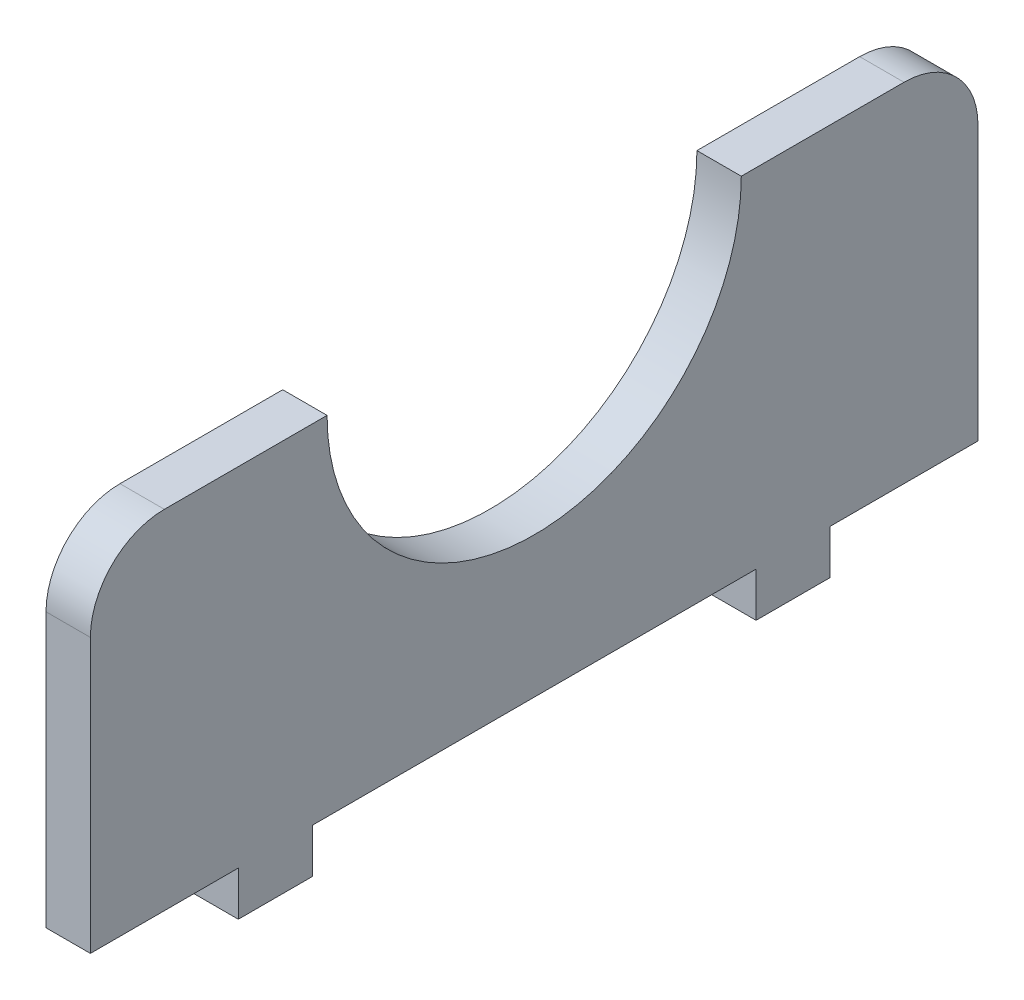
ISO-10303-21;
HEADER;
FILE_DESCRIPTION(('STEP AP214'),'2;1');
FILE_NAME('part.step','',(''),(''),'','','');
FILE_SCHEMA(('AUTOMOTIVE_DESIGN { 1 0 10303 214 1 1 1 1 }'));
ENDSEC;
DATA;
#1=APPLICATION_CONTEXT('core data for automotive mechanical design processes');
#2=APPLICATION_PROTOCOL_DEFINITION('international standard','automotive_design',2000,#1);
#3=PRODUCT_CONTEXT('',#1,'mechanical');
#4=PRODUCT('Part','Part','',(#3));
#5=PRODUCT_RELATED_PRODUCT_CATEGORY('part','',(#4));
#6=PRODUCT_DEFINITION_FORMATION('','',#4);
#7=PRODUCT_DEFINITION_CONTEXT('part definition',#1,'design');
#8=PRODUCT_DEFINITION('design','',#6,#7);
#9=PRODUCT_DEFINITION_SHAPE('','',#8);
#10=(LENGTH_UNIT() NAMED_UNIT(*) SI_UNIT(.MILLI.,.METRE.));
#11=(NAMED_UNIT(*) PLANE_ANGLE_UNIT() SI_UNIT($,.RADIAN.));
#12=(NAMED_UNIT(*) SI_UNIT($,.STERADIAN.) SOLID_ANGLE_UNIT());
#13=UNCERTAINTY_MEASURE_WITH_UNIT(LENGTH_MEASURE(1.E-05),#10,'distance_accuracy_value','');
#14=(GEOMETRIC_REPRESENTATION_CONTEXT(3) GLOBAL_UNCERTAINTY_ASSIGNED_CONTEXT((#13)) GLOBAL_UNIT_ASSIGNED_CONTEXT((#10,
#11,#12)) REPRESENTATION_CONTEXT('',''));
#15=CARTESIAN_POINT('',(0.,0.,0.));
#16=DIRECTION('',(0.,0.,1.));
#17=DIRECTION('',(1.,0.,0.));
#18=AXIS2_PLACEMENT_3D('',#15,#16,#17);
#19=CARTESIAN_POINT('',(3.,-11.75,-30.));
#20=DIRECTION('',(0.,1.,0.));
#21=DIRECTION('',(0.,0.,1.));
#22=AXIS2_PLACEMENT_3D('',#19,#20,#21);
#23=PLANE('',#22);
#24=DIRECTION('',(0.,0.,-1.));
#25=VECTOR('',#24,1.);
#26=CARTESIAN_POINT('',(0.,-11.75,-30.));
#27=LINE('',#26,#25);
#28=CARTESIAN_POINT('',(0.,-11.75,15.));
#29=VERTEX_POINT('',#28);
#30=CARTESIAN_POINT('',(0.,-11.75,-15.));
#31=VERTEX_POINT('',#30);
#32=EDGE_CURVE('E233',#29,#31,#27,.T.);
#33=ORIENTED_EDGE('',*,*,#32,.T.);
#34=DIRECTION('',(1.,0.,0.));
#35=VECTOR('',#34,1.);
#36=CARTESIAN_POINT('',(3.,-11.75,-15.));
#37=LINE('',#36,#35);
#38=CARTESIAN_POINT('',(3.,-11.75,-15.));
#39=VERTEX_POINT('',#38);
#40=EDGE_CURVE('E58',#31,#39,#37,.T.);
#41=ORIENTED_EDGE('',*,*,#40,.T.);
#42=DIRECTION('',(0.,0.,-1.));
#43=VECTOR('',#42,1.);
#44=CARTESIAN_POINT('',(3.,-11.75,-30.));
#45=LINE('',#44,#43);
#46=CARTESIAN_POINT('',(3.,-11.75,15.));
#47=VERTEX_POINT('',#46);
#48=EDGE_CURVE('E155',#47,#39,#45,.T.);
#49=ORIENTED_EDGE('',*,*,#48,.F.);
#50=DIRECTION('',(1.,0.,0.));
#51=VECTOR('',#50,1.);
#52=CARTESIAN_POINT('',(3.,-11.75,15.));
#53=LINE('',#52,#51);
#54=EDGE_CURVE('E190',#29,#47,#53,.T.);
#55=ORIENTED_EDGE('',*,*,#54,.F.);
#56=EDGE_LOOP('',(#33,#41,#49,#55));
#57=FACE_BOUND('',#56,.T.);
#58=ADVANCED_FACE('F35',(#57),#23,.F.);
#59=CARTESIAN_POINT('',(3.,-11.75,-20.));
#60=VERTEX_POINT('',#59);
#61=CARTESIAN_POINT('',(3.,-11.75,-30.));
#62=VERTEX_POINT('',#61);
#63=EDGE_CURVE('E50',#60,#62,#45,.T.);
#64=ORIENTED_EDGE('',*,*,#63,.F.);
#65=DIRECTION('',(-1.,0.,0.));
#66=VECTOR('',#65,1.);
#67=CARTESIAN_POINT('',(3.,-11.75,-20.));
#68=LINE('',#67,#66);
#69=CARTESIAN_POINT('',(0.,-11.75,-20.));
#70=VERTEX_POINT('',#69);
#71=EDGE_CURVE('E169',#60,#70,#68,.T.);
#72=ORIENTED_EDGE('',*,*,#71,.T.);
#73=CARTESIAN_POINT('',(0.,-11.75,-30.));
#74=VERTEX_POINT('',#73);
#75=EDGE_CURVE('E229',#70,#74,#27,.T.);
#76=ORIENTED_EDGE('',*,*,#75,.T.);
#77=DIRECTION('',(-1.,0.,0.));
#78=VECTOR('',#77,1.);
#79=CARTESIAN_POINT('',(3.,-11.75,-30.));
#80=LINE('',#79,#78);
#81=EDGE_CURVE('E247',#62,#74,#80,.T.);
#82=ORIENTED_EDGE('',*,*,#81,.F.);
#83=EDGE_LOOP('',(#64,#72,#76,#82));
#84=FACE_BOUND('',#83,.T.);
#85=ADVANCED_FACE('F296',(#84),#23,.F.);
#86=DIRECTION('',(-1.,0.,0.));
#87=VECTOR('',#86,1.);
#88=CARTESIAN_POINT('',(3.,-11.75,20.));
#89=LINE('',#88,#87);
#90=CARTESIAN_POINT('',(3.,-11.75,20.));
#91=VERTEX_POINT('',#90);
#92=CARTESIAN_POINT('',(0.,-11.75,20.));
#93=VERTEX_POINT('',#92);
#94=EDGE_CURVE('E158',#91,#93,#89,.T.);
#95=ORIENTED_EDGE('',*,*,#94,.F.);
#96=CARTESIAN_POINT('',(3.,-11.75,30.));
#97=VERTEX_POINT('',#96);
#98=EDGE_CURVE('E215',#97,#91,#45,.T.);
#99=ORIENTED_EDGE('',*,*,#98,.F.);
#100=DIRECTION('',(-1.,0.,0.));
#101=VECTOR('',#100,1.);
#102=CARTESIAN_POINT('',(3.,-11.75,30.));
#103=LINE('',#102,#101);
#104=CARTESIAN_POINT('',(0.,-11.75,30.));
#105=VERTEX_POINT('',#104);
#106=EDGE_CURVE('E250',#97,#105,#103,.T.);
#107=ORIENTED_EDGE('',*,*,#106,.T.);
#108=EDGE_CURVE('E230',#105,#93,#27,.T.);
#109=ORIENTED_EDGE('',*,*,#108,.T.);
#110=EDGE_LOOP('',(#95,#99,#107,#109));
#111=FACE_BOUND('',#110,.T.);
#112=ADVANCED_FACE('F283',(#111),#23,.F.);
#113=CARTESIAN_POINT('',(3.,-11.75,30.));
#114=DIRECTION('',(0.,0.,-1.));
#115=DIRECTION('',(0.,1.,0.));
#116=AXIS2_PLACEMENT_3D('',#113,#114,#115);
#117=PLANE('',#116);
#118=DIRECTION('',(0.,-1.,0.));
#119=VECTOR('',#118,1.);
#120=CARTESIAN_POINT('',(3.,-11.75,30.));
#121=LINE('',#120,#119);
#122=CARTESIAN_POINT('',(3.,6.75,30.));
#123=VERTEX_POINT('',#122);
#124=EDGE_CURVE('E212',#123,#97,#121,.T.);
#125=ORIENTED_EDGE('',*,*,#124,.F.);
#126=DIRECTION('',(-1.,0.,0.));
#127=VECTOR('',#126,1.);
#128=CARTESIAN_POINT('',(3.,6.75,30.));
#129=LINE('',#128,#127);
#130=CARTESIAN_POINT('',(0.,6.75,30.));
#131=VERTEX_POINT('',#130);
#132=EDGE_CURVE('E43',#123,#131,#129,.T.);
#133=ORIENTED_EDGE('',*,*,#132,.T.);
#134=DIRECTION('',(0.,-1.,0.));
#135=VECTOR('',#134,1.);
#136=CARTESIAN_POINT('',(0.,-11.75,30.));
#137=LINE('',#136,#135);
#138=EDGE_CURVE('E211',#131,#105,#137,.T.);
#139=ORIENTED_EDGE('',*,*,#138,.T.);
#140=ORIENTED_EDGE('',*,*,#106,.F.);
#141=EDGE_LOOP('',(#125,#133,#139,#140));
#142=FACE_BOUND('',#141,.T.);
#143=ADVANCED_FACE('F270',(#142),#117,.F.);
#144=CARTESIAN_POINT('',(3.,-11.75,-30.));
#145=DIRECTION('',(0.,0.,1.));
#146=DIRECTION('',(1.,0.,0.));
#147=AXIS2_PLACEMENT_3D('',#144,#145,#146);
#148=PLANE('',#147);
#149=DIRECTION('',(0.,1.,0.));
#150=VECTOR('',#149,1.);
#151=CARTESIAN_POINT('',(0.,-11.75,-30.));
#152=LINE('',#151,#150);
#153=CARTESIAN_POINT('',(0.,6.75,-30.));
#154=VERTEX_POINT('',#153);
#155=EDGE_CURVE('E232',#74,#154,#152,.T.);
#156=ORIENTED_EDGE('',*,*,#155,.T.);
#157=DIRECTION('',(-1.,0.,0.));
#158=VECTOR('',#157,1.);
#159=CARTESIAN_POINT('',(3.,6.75,-30.));
#160=LINE('',#159,#158);
#161=CARTESIAN_POINT('',(3.,6.75,-30.));
#162=VERTEX_POINT('',#161);
#163=EDGE_CURVE('E260',#154,#162,#160,.F.);
#164=ORIENTED_EDGE('',*,*,#163,.T.);
#165=DIRECTION('',(0.,1.,0.));
#166=VECTOR('',#165,1.);
#167=CARTESIAN_POINT('',(3.,-11.75,-30.));
#168=LINE('',#167,#166);
#169=EDGE_CURVE('E218',#62,#162,#168,.T.);
#170=ORIENTED_EDGE('',*,*,#169,.F.);
#171=ORIENTED_EDGE('',*,*,#81,.T.);
#172=EDGE_LOOP('',(#156,#164,#170,#171));
#173=FACE_BOUND('',#172,.T.);
#174=ADVANCED_FACE('F301',(#173),#148,.F.);
#175=CARTESIAN_POINT('',(3.,11.75,-30.));
#176=DIRECTION('',(0.,-1.,0.));
#177=DIRECTION('',(0.,0.,-1.));
#178=AXIS2_PLACEMENT_3D('',#175,#176,#177);
#179=PLANE('',#178);
#180=DIRECTION('',(0.,0.,1.));
#181=VECTOR('',#180,1.);
#182=CARTESIAN_POINT('',(3.,11.75,-30.));
#183=LINE('',#182,#181);
#184=CARTESIAN_POINT('',(3.,11.75,-25.));
#185=VERTEX_POINT('',#184);
#186=CARTESIAN_POINT('',(3.,11.75,-14.));
#187=VERTEX_POINT('',#186);
#188=EDGE_CURVE('E220',#185,#187,#183,.T.);
#189=ORIENTED_EDGE('',*,*,#188,.F.);
#190=DIRECTION('',(-1.,0.,0.));
#191=VECTOR('',#190,1.);
#192=CARTESIAN_POINT('',(3.,11.75,-25.));
#193=LINE('',#192,#191);
#194=CARTESIAN_POINT('',(0.,11.75,-25.));
#195=VERTEX_POINT('',#194);
#196=EDGE_CURVE('E253',#185,#195,#193,.T.);
#197=ORIENTED_EDGE('',*,*,#196,.T.);
#198=DIRECTION('',(0.,0.,1.));
#199=VECTOR('',#198,1.);
#200=CARTESIAN_POINT('',(0.,11.75,-30.));
#201=LINE('',#200,#199);
#202=CARTESIAN_POINT('',(0.,11.75,-14.));
#203=VERTEX_POINT('',#202);
#204=EDGE_CURVE('E236',#195,#203,#201,.T.);
#205=ORIENTED_EDGE('',*,*,#204,.T.);
#206=DIRECTION('',(-1.,0.,0.));
#207=VECTOR('',#206,1.);
#208=CARTESIAN_POINT('',(3.,11.75,-14.));
#209=LINE('',#208,#207);
#210=EDGE_CURVE('E244',#187,#203,#209,.T.);
#211=ORIENTED_EDGE('',*,*,#210,.F.);
#212=EDGE_LOOP('',(#189,#197,#205,#211));
#213=FACE_BOUND('',#212,.T.);
#214=ADVANCED_FACE('F310',(#213),#179,.F.);
#215=CARTESIAN_POINT('',(3.,11.75,0.));
#216=DIRECTION('',(-1.,0.,0.));
#217=DIRECTION('',(0.,0.,1.));
#218=AXIS2_PLACEMENT_3D('',#215,#216,#217);
#219=CYLINDRICAL_SURFACE('',#218,14.);
#220=CARTESIAN_POINT('',(0.,11.75,0.));
#221=DIRECTION('',(-1.,0.,0.));
#222=DIRECTION('',(0.,0.,-1.));
#223=AXIS2_PLACEMENT_3D('',#220,#221,#222);
#224=CIRCLE('',#223,14.);
#225=CARTESIAN_POINT('',(0.,11.75,14.));
#226=VERTEX_POINT('',#225);
#227=EDGE_CURVE('E238',#203,#226,#224,.T.);
#228=ORIENTED_EDGE('',*,*,#227,.T.);
#229=DIRECTION('',(-1.,0.,0.));
#230=VECTOR('',#229,1.);
#231=CARTESIAN_POINT('',(3.,11.75,14.));
#232=LINE('',#231,#230);
#233=CARTESIAN_POINT('',(3.,11.75,14.));
#234=VERTEX_POINT('',#233);
#235=EDGE_CURVE('E227',#234,#226,#232,.T.);
#236=ORIENTED_EDGE('',*,*,#235,.F.);
#237=CARTESIAN_POINT('',(3.,11.75,0.));
#238=DIRECTION('',(-1.,0.,0.));
#239=DIRECTION('',(0.,0.,-1.));
#240=AXIS2_PLACEMENT_3D('',#237,#238,#239);
#241=CIRCLE('',#240,14.);
#242=EDGE_CURVE('E222',#187,#234,#241,.T.);
#243=ORIENTED_EDGE('',*,*,#242,.F.);
#244=ORIENTED_EDGE('',*,*,#210,.T.);
#245=EDGE_LOOP('',(#228,#236,#243,#244));
#246=FACE_BOUND('',#245,.T.);
#247=ADVANCED_FACE('F353',(#246),#219,.F.);
#248=CARTESIAN_POINT('',(3.,11.75,14.));
#249=DIRECTION('',(0.,-1.,0.));
#250=DIRECTION('',(0.,0.,-1.));
#251=AXIS2_PLACEMENT_3D('',#248,#249,#250);
#252=PLANE('',#251);
#253=DIRECTION('',(0.,0.,1.));
#254=VECTOR('',#253,1.);
#255=CARTESIAN_POINT('',(0.,11.75,14.));
#256=LINE('',#255,#254);
#257=CARTESIAN_POINT('',(0.,11.75,25.));
#258=VERTEX_POINT('',#257);
#259=EDGE_CURVE('E214',#226,#258,#256,.T.);
#260=ORIENTED_EDGE('',*,*,#259,.T.);
#261=DIRECTION('',(-1.,0.,0.));
#262=VECTOR('',#261,1.);
#263=CARTESIAN_POINT('',(3.,11.75,25.));
#264=LINE('',#263,#262);
#265=CARTESIAN_POINT('',(3.,11.75,25.));
#266=VERTEX_POINT('',#265);
#267=EDGE_CURVE('E11',#258,#266,#264,.F.);
#268=ORIENTED_EDGE('',*,*,#267,.T.);
#269=DIRECTION('',(0.,0.,1.));
#270=VECTOR('',#269,1.);
#271=CARTESIAN_POINT('',(3.,11.75,14.));
#272=LINE('',#271,#270);
#273=EDGE_CURVE('E224',#234,#266,#272,.T.);
#274=ORIENTED_EDGE('',*,*,#273,.F.);
#275=ORIENTED_EDGE('',*,*,#235,.T.);
#276=EDGE_LOOP('',(#260,#268,#274,#275));
#277=FACE_BOUND('',#276,.T.);
#278=ADVANCED_FACE('F347',(#277),#252,.F.);
#279=CARTESIAN_POINT('',(3.,11.75,0.));
#280=DIRECTION('',(1.,0.,0.));
#281=DIRECTION('',(0.,0.,-1.));
#282=AXIS2_PLACEMENT_3D('',#279,#280,#281);
#283=PLANE('',#282);
#284=ORIENTED_EDGE('',*,*,#169,.T.);
#285=CARTESIAN_POINT('',(3.,6.75,-25.));
#286=DIRECTION('',(1.,0.,0.));
#287=DIRECTION('',(0.,0.,-1.));
#288=AXIS2_PLACEMENT_3D('',#285,#286,#287);
#289=CIRCLE('',#288,5.);
#290=EDGE_CURVE('E264',#162,#185,#289,.T.);
#291=ORIENTED_EDGE('',*,*,#290,.T.);
#292=ORIENTED_EDGE('',*,*,#188,.T.);
#293=ORIENTED_EDGE('',*,*,#242,.T.);
#294=ORIENTED_EDGE('',*,*,#273,.T.);
#295=CARTESIAN_POINT('',(3.,6.75,25.));
#296=DIRECTION('',(1.,0.,0.));
#297=DIRECTION('',(0.,0.,-1.));
#298=AXIS2_PLACEMENT_3D('',#295,#296,#297);
#299=CIRCLE('',#298,5.);
#300=EDGE_CURVE('E262',#266,#123,#299,.T.);
#301=ORIENTED_EDGE('',*,*,#300,.T.);
#302=ORIENTED_EDGE('',*,*,#124,.T.);
#303=ORIENTED_EDGE('',*,*,#98,.T.);
#304=DIRECTION('',(0.,1.,0.));
#305=VECTOR('',#304,1.);
#306=CARTESIAN_POINT('',(3.,-14.75,20.));
#307=LINE('',#306,#305);
#308=CARTESIAN_POINT('',(3.,-14.75,20.));
#309=VERTEX_POINT('',#308);
#310=EDGE_CURVE('E208',#309,#91,#307,.T.);
#311=ORIENTED_EDGE('',*,*,#310,.F.);
#312=DIRECTION('',(0.,0.,1.));
#313=VECTOR('',#312,1.);
#314=CARTESIAN_POINT('',(3.,-14.75,20.));
#315=LINE('',#314,#313);
#316=CARTESIAN_POINT('',(3.,-14.75,15.));
#317=VERTEX_POINT('',#316);
#318=EDGE_CURVE('E186',#317,#309,#315,.T.);
#319=ORIENTED_EDGE('',*,*,#318,.F.);
#320=DIRECTION('',(0.,1.,0.));
#321=VECTOR('',#320,1.);
#322=CARTESIAN_POINT('',(3.,-14.75,15.));
#323=LINE('',#322,#321);
#324=EDGE_CURVE('E196',#317,#47,#323,.T.);
#325=ORIENTED_EDGE('',*,*,#324,.T.);
#326=ORIENTED_EDGE('',*,*,#48,.T.);
#327=DIRECTION('',(0.,1.,0.));
#328=VECTOR('',#327,1.);
#329=CARTESIAN_POINT('',(3.,-14.75,-15.));
#330=LINE('',#329,#328);
#331=CARTESIAN_POINT('',(3.,-14.75,-15.));
#332=VERTEX_POINT('',#331);
#333=EDGE_CURVE('E148',#332,#39,#330,.T.);
#334=ORIENTED_EDGE('',*,*,#333,.F.);
#335=DIRECTION('',(0.,0.,-1.));
#336=VECTOR('',#335,1.);
#337=CARTESIAN_POINT('',(3.,-14.75,-20.));
#338=LINE('',#337,#336);
#339=CARTESIAN_POINT('',(3.,-14.75,-20.));
#340=VERTEX_POINT('',#339);
#341=EDGE_CURVE('E152',#332,#340,#338,.T.);
#342=ORIENTED_EDGE('',*,*,#341,.T.);
#343=DIRECTION('',(0.,1.,0.));
#344=VECTOR('',#343,1.);
#345=CARTESIAN_POINT('',(3.,-14.75,-20.));
#346=LINE('',#345,#344);
#347=EDGE_CURVE('E178',#340,#60,#346,.T.);
#348=ORIENTED_EDGE('',*,*,#347,.T.);
#349=ORIENTED_EDGE('',*,*,#63,.T.);
#350=EDGE_LOOP('',(#284,#291,#292,#293,#294,#301,#302,#303,#311,#319,#325,#326,#334,#342,#348,#349));
#351=FACE_BOUND('',#350,.T.);
#352=ADVANCED_FACE('F151',(#351),#283,.T.);
#353=CARTESIAN_POINT('',(0.,11.75,0.));
#354=DIRECTION('',(1.,0.,0.));
#355=DIRECTION('',(0.,0.,-1.));
#356=AXIS2_PLACEMENT_3D('',#353,#354,#355);
#357=PLANE('',#356);
#358=ORIENTED_EDGE('',*,*,#204,.F.);
#359=CARTESIAN_POINT('',(0.,6.75,-25.));
#360=DIRECTION('',(1.,0.,0.));
#361=DIRECTION('',(0.,0.,-1.));
#362=AXIS2_PLACEMENT_3D('',#359,#360,#361);
#363=CIRCLE('',#362,5.);
#364=EDGE_CURVE('E258',#195,#154,#363,.F.);
#365=ORIENTED_EDGE('',*,*,#364,.T.);
#366=ORIENTED_EDGE('',*,*,#155,.F.);
#367=ORIENTED_EDGE('',*,*,#75,.F.);
#368=DIRECTION('',(0.,1.,0.));
#369=VECTOR('',#368,1.);
#370=CARTESIAN_POINT('',(0.,-14.75,-20.));
#371=LINE('',#370,#369);
#372=CARTESIAN_POINT('',(0.,-14.75,-20.));
#373=VERTEX_POINT('',#372);
#374=EDGE_CURVE('E182',#373,#70,#371,.T.);
#375=ORIENTED_EDGE('',*,*,#374,.F.);
#376=DIRECTION('',(0.,0.,1.));
#377=VECTOR('',#376,1.);
#378=CARTESIAN_POINT('',(0.,-14.75,-20.));
#379=LINE('',#378,#377);
#380=CARTESIAN_POINT('',(0.,-14.75,-15.));
#381=VERTEX_POINT('',#380);
#382=EDGE_CURVE('E173',#373,#381,#379,.T.);
#383=ORIENTED_EDGE('',*,*,#382,.T.);
#384=DIRECTION('',(0.,1.,0.));
#385=VECTOR('',#384,1.);
#386=CARTESIAN_POINT('',(0.,-14.75,-15.));
#387=LINE('',#386,#385);
#388=EDGE_CURVE('E159',#381,#31,#387,.T.);
#389=ORIENTED_EDGE('',*,*,#388,.T.);
#390=ORIENTED_EDGE('',*,*,#32,.F.);
#391=DIRECTION('',(0.,1.,0.));
#392=VECTOR('',#391,1.);
#393=CARTESIAN_POINT('',(0.,-14.75,15.));
#394=LINE('',#393,#392);
#395=CARTESIAN_POINT('',(0.,-14.75,15.));
#396=VERTEX_POINT('',#395);
#397=EDGE_CURVE('E202',#396,#29,#394,.T.);
#398=ORIENTED_EDGE('',*,*,#397,.F.);
#399=DIRECTION('',(0.,0.,-1.));
#400=VECTOR('',#399,1.);
#401=CARTESIAN_POINT('',(0.,-14.75,20.));
#402=LINE('',#401,#400);
#403=CARTESIAN_POINT('',(0.,-14.75,20.));
#404=VERTEX_POINT('',#403);
#405=EDGE_CURVE('E192',#404,#396,#402,.T.);
#406=ORIENTED_EDGE('',*,*,#405,.F.);
#407=DIRECTION('',(0.,1.,0.));
#408=VECTOR('',#407,1.);
#409=CARTESIAN_POINT('',(0.,-14.75,20.));
#410=LINE('',#409,#408);
#411=EDGE_CURVE('E205',#404,#93,#410,.T.);
#412=ORIENTED_EDGE('',*,*,#411,.T.);
#413=ORIENTED_EDGE('',*,*,#108,.F.);
#414=ORIENTED_EDGE('',*,*,#138,.F.);
#415=CARTESIAN_POINT('',(0.,6.75,25.));
#416=DIRECTION('',(1.,0.,0.));
#417=DIRECTION('',(0.,0.,-1.));
#418=AXIS2_PLACEMENT_3D('',#415,#416,#417);
#419=CIRCLE('',#418,5.);
#420=EDGE_CURVE('E256',#131,#258,#419,.F.);
#421=ORIENTED_EDGE('',*,*,#420,.T.);
#422=ORIENTED_EDGE('',*,*,#259,.F.);
#423=ORIENTED_EDGE('',*,*,#227,.F.);
#424=EDGE_LOOP('',(#358,#365,#366,#367,#375,#383,#389,#390,#398,#406,#412,#413,#414,#421,#422,#423));
#425=FACE_BOUND('',#424,.T.);
#426=ADVANCED_FACE('F277',(#425),#357,.F.);
#427=CARTESIAN_POINT('',(3.,6.75,-25.));
#428=DIRECTION('',(-1.,0.,0.));
#429=DIRECTION('',(0.,0.,1.));
#430=AXIS2_PLACEMENT_3D('',#427,#428,#429);
#431=CYLINDRICAL_SURFACE('',#430,5.);
#432=ORIENTED_EDGE('',*,*,#290,.F.);
#433=ORIENTED_EDGE('',*,*,#163,.F.);
#434=ORIENTED_EDGE('',*,*,#364,.F.);
#435=ORIENTED_EDGE('',*,*,#196,.F.);
#436=EDGE_LOOP('',(#432,#433,#434,#435));
#437=FACE_BOUND('',#436,.T.);
#438=ADVANCED_FACE('F307',(#437),#431,.T.);
#439=CARTESIAN_POINT('',(3.,6.75,25.));
#440=DIRECTION('',(-1.,0.,0.));
#441=DIRECTION('',(0.,0.,1.));
#442=AXIS2_PLACEMENT_3D('',#439,#440,#441);
#443=CYLINDRICAL_SURFACE('',#442,5.);
#444=ORIENTED_EDGE('',*,*,#300,.F.);
#445=ORIENTED_EDGE('',*,*,#267,.F.);
#446=ORIENTED_EDGE('',*,*,#420,.F.);
#447=ORIENTED_EDGE('',*,*,#132,.F.);
#448=EDGE_LOOP('',(#444,#445,#446,#447));
#449=FACE_BOUND('',#448,.T.);
#450=ADVANCED_FACE('F37',(#449),#443,.T.);
#451=CARTESIAN_POINT('',(3.,-14.75,20.));
#452=DIRECTION('',(0.,0.,-1.));
#453=DIRECTION('',(0.,1.,0.));
#454=AXIS2_PLACEMENT_3D('',#451,#452,#453);
#455=PLANE('',#454);
#456=ORIENTED_EDGE('',*,*,#94,.T.);
#457=ORIENTED_EDGE('',*,*,#411,.F.);
#458=DIRECTION('',(-1.,0.,0.));
#459=VECTOR('',#458,1.);
#460=CARTESIAN_POINT('',(3.,-14.75,20.));
#461=LINE('',#460,#459);
#462=EDGE_CURVE('E189',#309,#404,#461,.T.);
#463=ORIENTED_EDGE('',*,*,#462,.F.);
#464=ORIENTED_EDGE('',*,*,#310,.T.);
#465=EDGE_LOOP('',(#456,#457,#463,#464));
#466=FACE_BOUND('',#465,.T.);
#467=ADVANCED_FACE('F287',(#466),#455,.F.);
#468=CARTESIAN_POINT('',(3.,-14.75,15.));
#469=DIRECTION('',(0.,0.,1.));
#470=DIRECTION('',(0.,-1.,0.));
#471=AXIS2_PLACEMENT_3D('',#468,#469,#470);
#472=PLANE('',#471);
#473=ORIENTED_EDGE('',*,*,#54,.T.);
#474=ORIENTED_EDGE('',*,*,#324,.F.);
#475=DIRECTION('',(1.,0.,0.));
#476=VECTOR('',#475,1.);
#477=CARTESIAN_POINT('',(3.,-14.75,15.));
#478=LINE('',#477,#476);
#479=EDGE_CURVE('E194',#396,#317,#478,.T.);
#480=ORIENTED_EDGE('',*,*,#479,.F.);
#481=ORIENTED_EDGE('',*,*,#397,.T.);
#482=EDGE_LOOP('',(#473,#474,#480,#481));
#483=FACE_BOUND('',#482,.T.);
#484=ADVANCED_FACE('F293',(#483),#472,.F.);
#485=CARTESIAN_POINT('',(0.,-14.75,0.));
#486=DIRECTION('',(0.,1.,0.));
#487=DIRECTION('',(0.,0.,1.));
#488=AXIS2_PLACEMENT_3D('',#485,#486,#487);
#489=PLANE('',#488);
#490=ORIENTED_EDGE('',*,*,#318,.T.);
#491=ORIENTED_EDGE('',*,*,#462,.T.);
#492=ORIENTED_EDGE('',*,*,#405,.T.);
#493=ORIENTED_EDGE('',*,*,#479,.T.);
#494=EDGE_LOOP('',(#490,#491,#492,#493));
#495=FACE_BOUND('',#494,.T.);
#496=ADVANCED_FACE('F289',(#495),#489,.F.);
#497=CARTESIAN_POINT('',(3.,-14.75,-15.));
#498=DIRECTION('',(0.,0.,1.));
#499=DIRECTION('',(0.,-1.,0.));
#500=AXIS2_PLACEMENT_3D('',#497,#498,#499);
#501=PLANE('',#500);
#502=ORIENTED_EDGE('',*,*,#40,.F.);
#503=ORIENTED_EDGE('',*,*,#388,.F.);
#504=DIRECTION('',(1.,0.,0.));
#505=VECTOR('',#504,1.);
#506=CARTESIAN_POINT('',(3.,-14.75,-15.));
#507=LINE('',#506,#505);
#508=EDGE_CURVE('E165',#381,#332,#507,.T.);
#509=ORIENTED_EDGE('',*,*,#508,.T.);
#510=ORIENTED_EDGE('',*,*,#333,.T.);
#511=EDGE_LOOP('',(#502,#503,#509,#510));
#512=FACE_BOUND('',#511,.T.);
#513=ADVANCED_FACE('F171',(#512),#501,.T.);
#514=CARTESIAN_POINT('',(3.,-14.75,-20.));
#515=DIRECTION('',(0.,0.,-1.));
#516=DIRECTION('',(0.,1.,0.));
#517=AXIS2_PLACEMENT_3D('',#514,#515,#516);
#518=PLANE('',#517);
#519=ORIENTED_EDGE('',*,*,#71,.F.);
#520=ORIENTED_EDGE('',*,*,#347,.F.);
#521=DIRECTION('',(-1.,0.,0.));
#522=VECTOR('',#521,1.);
#523=CARTESIAN_POINT('',(3.,-14.75,-20.));
#524=LINE('',#523,#522);
#525=EDGE_CURVE('E168',#340,#373,#524,.T.);
#526=ORIENTED_EDGE('',*,*,#525,.T.);
#527=ORIENTED_EDGE('',*,*,#374,.T.);
#528=EDGE_LOOP('',(#519,#520,#526,#527));
#529=FACE_BOUND('',#528,.T.);
#530=ADVANCED_FACE('F315',(#529),#518,.T.);
#531=CARTESIAN_POINT('',(0.,-14.75,0.));
#532=DIRECTION('',(0.,1.,0.));
#533=DIRECTION('',(0.,0.,-1.));
#534=AXIS2_PLACEMENT_3D('',#531,#532,#533);
#535=PLANE('',#534);
#536=ORIENTED_EDGE('',*,*,#341,.F.);
#537=ORIENTED_EDGE('',*,*,#508,.F.);
#538=ORIENTED_EDGE('',*,*,#382,.F.);
#539=ORIENTED_EDGE('',*,*,#525,.F.);
#540=EDGE_LOOP('',(#536,#537,#538,#539));
#541=FACE_BOUND('',#540,.T.);
#542=ADVANCED_FACE('F163',(#541),#535,.F.);
#543=CLOSED_SHELL('',(#58,#85,#112,#143,#174,#214,#247,#278,#352,#426,#438,#450,#467,#484,#496,
#513,#530,#542));
#544=MANIFOLD_SOLID_BREP('B2',#543);
#545=ADVANCED_BREP_SHAPE_REPRESENTATION('',(#18,#544),#14);
#546=SHAPE_DEFINITION_REPRESENTATION(#9,#545);
ENDSEC;
END-ISO-10303-21;
